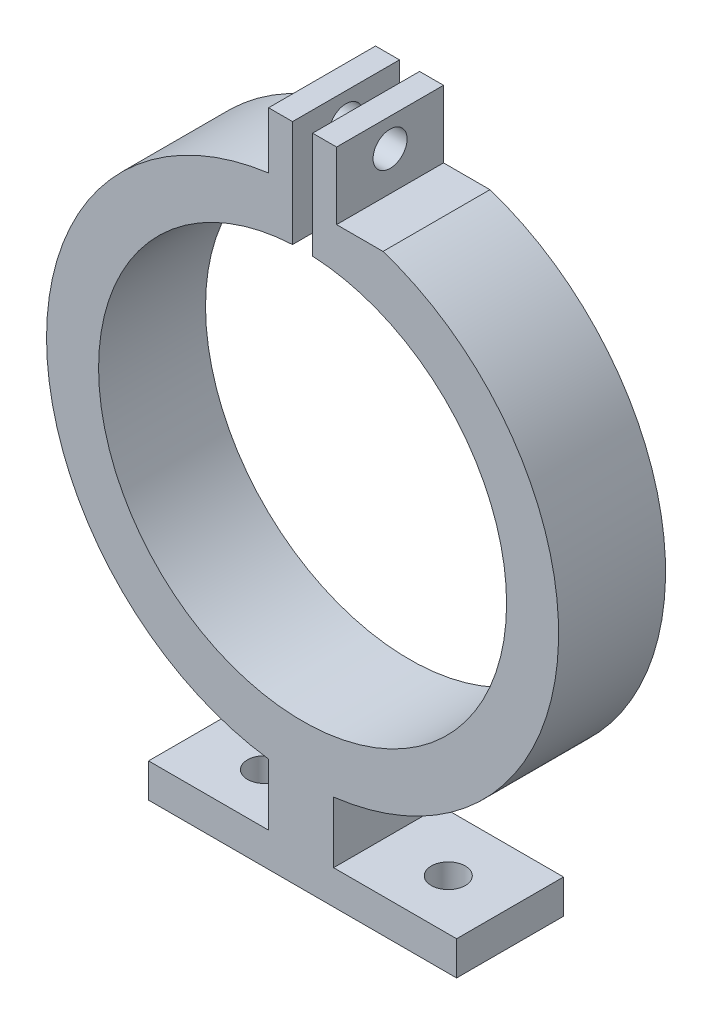
ISO-10303-21;
HEADER;
FILE_DESCRIPTION(('STEP AP214'),'2;1');
FILE_NAME('part.step','',(''),(''),'','','');
FILE_SCHEMA(('AUTOMOTIVE_DESIGN { 1 0 10303 214 1 1 1 1 }'));
ENDSEC;
DATA;
#1=APPLICATION_CONTEXT('core data for automotive mechanical design processes');
#2=APPLICATION_PROTOCOL_DEFINITION('international standard','automotive_design',2000,#1);
#3=PRODUCT_CONTEXT('',#1,'mechanical');
#4=PRODUCT('Part','Part','',(#3));
#5=PRODUCT_RELATED_PRODUCT_CATEGORY('part','',(#4));
#6=PRODUCT_DEFINITION_FORMATION('','',#4);
#7=PRODUCT_DEFINITION_CONTEXT('part definition',#1,'design');
#8=PRODUCT_DEFINITION('design','',#6,#7);
#9=PRODUCT_DEFINITION_SHAPE('','',#8);
#10=(LENGTH_UNIT() NAMED_UNIT(*) SI_UNIT(.MILLI.,.METRE.));
#11=(NAMED_UNIT(*) PLANE_ANGLE_UNIT() SI_UNIT($,.RADIAN.));
#12=(NAMED_UNIT(*) SI_UNIT($,.STERADIAN.) SOLID_ANGLE_UNIT());
#13=UNCERTAINTY_MEASURE_WITH_UNIT(LENGTH_MEASURE(1.E-05),#10,'distance_accuracy_value','');
#14=(GEOMETRIC_REPRESENTATION_CONTEXT(3) GLOBAL_UNCERTAINTY_ASSIGNED_CONTEXT((#13)) GLOBAL_UNIT_ASSIGNED_CONTEXT((#10,
#11,#12)) REPRESENTATION_CONTEXT('',''));
#15=CARTESIAN_POINT('',(0.,0.,0.));
#16=DIRECTION('',(0.,0.,1.));
#17=DIRECTION('',(1.,0.,0.));
#18=AXIS2_PLACEMENT_3D('',#15,#16,#17);
#19=CARTESIAN_POINT('',(0.,0.,10.));
#20=DIRECTION('',(0.,0.,-1.));
#21=DIRECTION('',(-1.,0.,0.));
#22=AXIS2_PLACEMENT_3D('',#19,#20,#21);
#23=CYLINDRICAL_SURFACE('',#22,23.94);
#24=DIRECTION('',(0.,0.,-1.));
#25=VECTOR('',#24,1.);
#26=CARTESIAN_POINT('',(7.52117770646284,22.7278570460967,10.));
#27=LINE('',#26,#25);
#28=CARTESIAN_POINT('',(7.52117770646283,22.7278570460967,10.));
#29=VERTEX_POINT('',#28);
#30=CARTESIAN_POINT('',(7.52117770646283,22.7278570460967,0.));
#31=VERTEX_POINT('',#30);
#32=EDGE_CURVE('E182',#29,#31,#27,.T.);
#33=ORIENTED_EDGE('',*,*,#32,.F.);
#34=CARTESIAN_POINT('',(0.,0.,10.));
#35=DIRECTION('',(0.,0.,1.));
#36=DIRECTION('',(1.,0.,0.));
#37=AXIS2_PLACEMENT_3D('',#34,#35,#36);
#38=CIRCLE('',#37,23.94);
#39=CARTESIAN_POINT('',(2.89957420992693,-23.7637553724391,10.));
#40=VERTEX_POINT('',#39);
#41=EDGE_CURVE('E170',#40,#29,#38,.T.);
#42=ORIENTED_EDGE('',*,*,#41,.F.);
#43=DIRECTION('',(0.,0.,-1.));
#44=VECTOR('',#43,1.);
#45=CARTESIAN_POINT('',(2.89957420992693,-23.7637553724391,10.));
#46=LINE('',#45,#44);
#47=CARTESIAN_POINT('',(2.89957420992693,-23.7637553724391,0.));
#48=VERTEX_POINT('',#47);
#49=EDGE_CURVE('E329',#40,#48,#46,.T.);
#50=ORIENTED_EDGE('',*,*,#49,.T.);
#51=CARTESIAN_POINT('',(0.,0.,0.));
#52=DIRECTION('',(0.,0.,1.));
#53=DIRECTION('',(1.,0.,0.));
#54=AXIS2_PLACEMENT_3D('',#51,#52,#53);
#55=CIRCLE('',#54,23.94);
#56=EDGE_CURVE('E307',#48,#31,#55,.T.);
#57=ORIENTED_EDGE('',*,*,#56,.T.);
#58=EDGE_LOOP('',(#33,#42,#50,#57));
#59=FACE_BOUND('',#58,.T.);
#60=ADVANCED_FACE('F38',(#59),#23,.T.);
#61=CARTESIAN_POINT('',(0.,0.,10.));
#62=DIRECTION('',(0.,0.,-1.));
#63=DIRECTION('',(-1.,0.,0.));
#64=AXIS2_PLACEMENT_3D('',#61,#62,#63);
#65=PLANE('',#64);
#66=DIRECTION('',(-1.,0.,0.));
#67=VECTOR('',#66,1.);
#68=CARTESIAN_POINT('',(32.898,22.7278570460967,10.));
#69=LINE('',#68,#67);
#70=CARTESIAN_POINT('',(3.18,22.7278570460967,10.));
#71=VERTEX_POINT('',#70);
#72=EDGE_CURVE('E174',#29,#71,#69,.T.);
#73=ORIENTED_EDGE('',*,*,#72,.T.);
#74=DIRECTION('',(0.,1.,0.));
#75=VECTOR('',#74,1.);
#76=CARTESIAN_POINT('',(3.18,23.7278570460967,10.));
#77=LINE('',#76,#75);
#78=CARTESIAN_POINT('',(3.18,29.0113324711321,10.));
#79=VERTEX_POINT('',#78);
#80=EDGE_CURVE('E157',#71,#79,#77,.T.);
#81=ORIENTED_EDGE('',*,*,#80,.T.);
#82=DIRECTION('',(-1.,0.,0.));
#83=VECTOR('',#82,1.);
#84=CARTESIAN_POINT('',(-3.18,29.0113324711321,10.));
#85=LINE('',#84,#83);
#86=CARTESIAN_POINT('',(0.938544964266418,29.0113324711321,10.));
#87=VERTEX_POINT('',#86);
#88=EDGE_CURVE('E276',#79,#87,#85,.T.);
#89=ORIENTED_EDGE('',*,*,#88,.T.);
#90=DIRECTION('',(0.,1.,0.));
#91=VECTOR('',#90,1.);
#92=CARTESIAN_POINT('',(0.938544964266418,29.0113324711321,10.));
#93=LINE('',#92,#91);
#94=CARTESIAN_POINT('',(0.938544964266417,19.0518964502238,10.));
#95=VERTEX_POINT('',#94);
#96=EDGE_CURVE('E218',#95,#87,#93,.T.);
#97=ORIENTED_EDGE('',*,*,#96,.F.);
#98=CARTESIAN_POINT('',(0.,0.,10.));
#99=DIRECTION('',(0.,0.,1.));
#100=DIRECTION('',(1.,0.,0.));
#101=AXIS2_PLACEMENT_3D('',#98,#99,#100);
#102=CIRCLE('',#101,19.075);
#103=CARTESIAN_POINT('',(-0.938544964266394,19.0518964502238,10.));
#104=VERTEX_POINT('',#103);
#105=EDGE_CURVE('E230',#104,#95,#102,.T.);
#106=ORIENTED_EDGE('',*,*,#105,.F.);
#107=DIRECTION('',(0.,-1.,0.));
#108=VECTOR('',#107,1.);
#109=CARTESIAN_POINT('',(-0.938544964266418,29.0113324711321,10.));
#110=LINE('',#109,#108);
#111=CARTESIAN_POINT('',(-0.938544964266418,29.0113324711321,10.));
#112=VERTEX_POINT('',#111);
#113=EDGE_CURVE('E61',#112,#104,#110,.T.);
#114=ORIENTED_EDGE('',*,*,#113,.F.);
#115=CARTESIAN_POINT('',(-3.18,29.0113324711321,10.));
#116=VERTEX_POINT('',#115);
#117=EDGE_CURVE('E169',#112,#116,#85,.T.);
#118=ORIENTED_EDGE('',*,*,#117,.T.);
#119=DIRECTION('',(0.,-1.,0.));
#120=VECTOR('',#119,1.);
#121=CARTESIAN_POINT('',(-3.18,23.7278570460967,10.));
#122=LINE('',#121,#120);
#123=CARTESIAN_POINT('',(-3.18,23.7278570460967,10.));
#124=VERTEX_POINT('',#123);
#125=EDGE_CURVE('E279',#116,#124,#122,.T.);
#126=ORIENTED_EDGE('',*,*,#125,.T.);
#127=CARTESIAN_POINT('',(0.,0.,10.));
#128=DIRECTION('',(0.,0.,1.));
#129=DIRECTION('',(-1.,0.,0.));
#130=AXIS2_PLACEMENT_3D('',#127,#128,#129);
#131=CIRCLE('',#130,23.94);
#132=CARTESIAN_POINT('',(-3.18,-23.7278570460967,10.));
#133=VERTEX_POINT('',#132);
#134=EDGE_CURVE('E248',#124,#133,#131,.T.);
#135=ORIENTED_EDGE('',*,*,#134,.T.);
#136=DIRECTION('',(0.,-1.,0.));
#137=VECTOR('',#136,1.);
#138=CARTESIAN_POINT('',(-3.18,-23.7278570460967,10.));
#139=LINE('',#138,#137);
#140=CARTESIAN_POINT('',(-3.18,-29.4861183026498,10.));
#141=VERTEX_POINT('',#140);
#142=EDGE_CURVE('E252',#133,#141,#139,.T.);
#143=ORIENTED_EDGE('',*,*,#142,.T.);
#144=DIRECTION('',(-1.,0.,0.));
#145=VECTOR('',#144,1.);
#146=CARTESIAN_POINT('',(-14.4009100758397,-29.4861183026498,10.));
#147=LINE('',#146,#145);
#148=CARTESIAN_POINT('',(-14.4009100758397,-29.4861183026498,10.));
#149=VERTEX_POINT('',#148);
#150=EDGE_CURVE('E256',#141,#149,#147,.T.);
#151=ORIENTED_EDGE('',*,*,#150,.T.);
#152=DIRECTION('',(0.,-1.,0.));
#153=VECTOR('',#152,1.);
#154=CARTESIAN_POINT('',(-14.4009100758397,-32.6661183026498,10.));
#155=LINE('',#154,#153);
#156=CARTESIAN_POINT('',(-14.4009100758397,-32.6661183026498,10.));
#157=VERTEX_POINT('',#156);
#158=EDGE_CURVE('E259',#149,#157,#155,.T.);
#159=ORIENTED_EDGE('',*,*,#158,.T.);
#160=DIRECTION('',(1.,0.,0.));
#161=VECTOR('',#160,1.);
#162=CARTESIAN_POINT('',(14.4009100758397,-32.6661183026498,10.));
#163=LINE('',#162,#161);
#164=CARTESIAN_POINT('',(14.4009100758397,-32.6661183026498,10.));
#165=VERTEX_POINT('',#164);
#166=EDGE_CURVE('E262',#157,#165,#163,.T.);
#167=ORIENTED_EDGE('',*,*,#166,.T.);
#168=DIRECTION('',(0.,1.,0.));
#169=VECTOR('',#168,1.);
#170=CARTESIAN_POINT('',(14.4009100758397,-32.6661183026498,10.));
#171=LINE('',#170,#169);
#172=CARTESIAN_POINT('',(14.4009100758397,-29.4861183026498,10.));
#173=VERTEX_POINT('',#172);
#174=EDGE_CURVE('E265',#165,#173,#171,.T.);
#175=ORIENTED_EDGE('',*,*,#174,.T.);
#176=DIRECTION('',(-1.,0.,0.));
#177=VECTOR('',#176,1.);
#178=CARTESIAN_POINT('',(14.4009100758397,-29.4861183026498,10.));
#179=LINE('',#178,#177);
#180=CARTESIAN_POINT('',(2.89957420992693,-29.4861183026498,10.));
#181=VERTEX_POINT('',#180);
#182=EDGE_CURVE('E268',#173,#181,#179,.T.);
#183=ORIENTED_EDGE('',*,*,#182,.T.);
#184=DIRECTION('',(0.,1.,0.));
#185=VECTOR('',#184,1.);
#186=CARTESIAN_POINT('',(2.89957420992693,-23.7637553724391,10.));
#187=LINE('',#186,#185);
#188=EDGE_CURVE('E271',#181,#40,#187,.T.);
#189=ORIENTED_EDGE('',*,*,#188,.T.);
#190=ORIENTED_EDGE('',*,*,#41,.T.);
#191=EDGE_LOOP('',(#73,#81,#89,#97,#106,#114,#118,#126,#135,#143,#151,#159,#167,#175,#183,#189,#190));
#192=FACE_BOUND('',#191,.T.);
#193=ADVANCED_FACE('F179',(#192),#65,.F.);
#194=CARTESIAN_POINT('',(0.,0.,0.));
#195=DIRECTION('',(0.,0.,-1.));
#196=DIRECTION('',(-1.,0.,0.));
#197=AXIS2_PLACEMENT_3D('',#194,#195,#196);
#198=PLANE('',#197);
#199=DIRECTION('',(0.,1.,0.));
#200=VECTOR('',#199,1.);
#201=CARTESIAN_POINT('',(3.18,23.7278570460967,0.));
#202=LINE('',#201,#200);
#203=CARTESIAN_POINT('',(3.18,22.7278570460967,0.));
#204=VERTEX_POINT('',#203);
#205=CARTESIAN_POINT('',(3.18,29.0113324711321,0.));
#206=VERTEX_POINT('',#205);
#207=EDGE_CURVE('E53',#204,#206,#202,.T.);
#208=ORIENTED_EDGE('',*,*,#207,.F.);
#209=DIRECTION('',(1.,0.,0.));
#210=VECTOR('',#209,1.);
#211=CARTESIAN_POINT('',(0.,22.7278570460967,0.));
#212=LINE('',#211,#210);
#213=EDGE_CURVE('E11',#204,#31,#212,.T.);
#214=ORIENTED_EDGE('',*,*,#213,.T.);
#215=ORIENTED_EDGE('',*,*,#56,.F.);
#216=DIRECTION('',(0.,1.,0.));
#217=VECTOR('',#216,1.);
#218=CARTESIAN_POINT('',(2.89957420992693,-23.7637553724391,0.));
#219=LINE('',#218,#217);
#220=CARTESIAN_POINT('',(2.89957420992693,-29.4861183026498,0.));
#221=VERTEX_POINT('',#220);
#222=EDGE_CURVE('E304',#221,#48,#219,.T.);
#223=ORIENTED_EDGE('',*,*,#222,.F.);
#224=DIRECTION('',(-1.,0.,0.));
#225=VECTOR('',#224,1.);
#226=CARTESIAN_POINT('',(14.4009100758397,-29.4861183026498,0.));
#227=LINE('',#226,#225);
#228=CARTESIAN_POINT('',(14.4009100758397,-29.4861183026498,0.));
#229=VERTEX_POINT('',#228);
#230=EDGE_CURVE('E301',#229,#221,#227,.T.);
#231=ORIENTED_EDGE('',*,*,#230,.F.);
#232=DIRECTION('',(0.,1.,0.));
#233=VECTOR('',#232,1.);
#234=CARTESIAN_POINT('',(14.4009100758397,-32.6661183026498,0.));
#235=LINE('',#234,#233);
#236=CARTESIAN_POINT('',(14.4009100758397,-32.6661183026498,0.));
#237=VERTEX_POINT('',#236);
#238=EDGE_CURVE('E298',#237,#229,#235,.T.);
#239=ORIENTED_EDGE('',*,*,#238,.F.);
#240=DIRECTION('',(1.,0.,0.));
#241=VECTOR('',#240,1.);
#242=CARTESIAN_POINT('',(14.4009100758397,-32.6661183026498,0.));
#243=LINE('',#242,#241);
#244=CARTESIAN_POINT('',(-14.4009100758397,-32.6661183026498,0.));
#245=VERTEX_POINT('',#244);
#246=EDGE_CURVE('E295',#245,#237,#243,.T.);
#247=ORIENTED_EDGE('',*,*,#246,.F.);
#248=DIRECTION('',(0.,-1.,0.));
#249=VECTOR('',#248,1.);
#250=CARTESIAN_POINT('',(-14.4009100758397,-32.6661183026498,0.));
#251=LINE('',#250,#249);
#252=CARTESIAN_POINT('',(-14.4009100758397,-29.4861183026498,0.));
#253=VERTEX_POINT('',#252);
#254=EDGE_CURVE('E292',#253,#245,#251,.T.);
#255=ORIENTED_EDGE('',*,*,#254,.F.);
#256=DIRECTION('',(-1.,0.,0.));
#257=VECTOR('',#256,1.);
#258=CARTESIAN_POINT('',(-14.4009100758397,-29.4861183026498,0.));
#259=LINE('',#258,#257);
#260=CARTESIAN_POINT('',(-3.18,-29.4861183026498,0.));
#261=VERTEX_POINT('',#260);
#262=EDGE_CURVE('E289',#261,#253,#259,.T.);
#263=ORIENTED_EDGE('',*,*,#262,.F.);
#264=DIRECTION('',(0.,-1.,0.));
#265=VECTOR('',#264,1.);
#266=CARTESIAN_POINT('',(-3.18,-23.7278570460967,0.));
#267=LINE('',#266,#265);
#268=CARTESIAN_POINT('',(-3.18,-23.7278570460967,0.));
#269=VERTEX_POINT('',#268);
#270=EDGE_CURVE('E286',#269,#261,#267,.T.);
#271=ORIENTED_EDGE('',*,*,#270,.F.);
#272=CARTESIAN_POINT('',(0.,0.,0.));
#273=DIRECTION('',(0.,0.,1.));
#274=DIRECTION('',(-1.,0.,0.));
#275=AXIS2_PLACEMENT_3D('',#272,#273,#274);
#276=CIRCLE('',#275,23.94);
#277=CARTESIAN_POINT('',(-3.18,23.7278570460967,0.));
#278=VERTEX_POINT('',#277);
#279=EDGE_CURVE('E244',#278,#269,#276,.T.);
#280=ORIENTED_EDGE('',*,*,#279,.F.);
#281=DIRECTION('',(0.,-1.,0.));
#282=VECTOR('',#281,1.);
#283=CARTESIAN_POINT('',(-3.18,23.7278570460967,0.));
#284=LINE('',#283,#282);
#285=CARTESIAN_POINT('',(-3.18,29.0113324711321,0.));
#286=VERTEX_POINT('',#285);
#287=EDGE_CURVE('E253',#286,#278,#284,.T.);
#288=ORIENTED_EDGE('',*,*,#287,.F.);
#289=DIRECTION('',(-1.,0.,0.));
#290=VECTOR('',#289,1.);
#291=CARTESIAN_POINT('',(-3.18,29.0113324711321,0.));
#292=LINE('',#291,#290);
#293=CARTESIAN_POINT('',(-0.938544964266418,29.0113324711321,0.));
#294=VERTEX_POINT('',#293);
#295=EDGE_CURVE('E313',#294,#286,#292,.T.);
#296=ORIENTED_EDGE('',*,*,#295,.F.);
#297=DIRECTION('',(0.,-1.,0.));
#298=VECTOR('',#297,1.);
#299=CARTESIAN_POINT('',(-0.938544964266418,29.0113324711321,0.));
#300=LINE('',#299,#298);
#301=CARTESIAN_POINT('',(-0.938544964266417,19.0518964502238,0.));
#302=VERTEX_POINT('',#301);
#303=EDGE_CURVE('E213',#294,#302,#300,.T.);
#304=ORIENTED_EDGE('',*,*,#303,.T.);
#305=CARTESIAN_POINT('',(0.,0.,0.));
#306=DIRECTION('',(0.,0.,1.));
#307=DIRECTION('',(1.,0.,0.));
#308=AXIS2_PLACEMENT_3D('',#305,#306,#307);
#309=CIRCLE('',#308,19.075);
#310=CARTESIAN_POINT('',(0.938544964266416,19.0518964502238,0.));
#311=VERTEX_POINT('',#310);
#312=EDGE_CURVE('E240',#302,#311,#309,.T.);
#313=ORIENTED_EDGE('',*,*,#312,.T.);
#314=DIRECTION('',(0.,1.,0.));
#315=VECTOR('',#314,1.);
#316=CARTESIAN_POINT('',(0.938544964266418,29.0113324711321,0.));
#317=LINE('',#316,#315);
#318=CARTESIAN_POINT('',(0.938544964266418,29.0113324711321,0.));
#319=VERTEX_POINT('',#318);
#320=EDGE_CURVE('E217',#311,#319,#317,.T.);
#321=ORIENTED_EDGE('',*,*,#320,.T.);
#322=EDGE_CURVE('E314',#206,#319,#292,.T.);
#323=ORIENTED_EDGE('',*,*,#322,.F.);
#324=EDGE_LOOP('',(#208,#214,#215,#223,#231,#239,#247,#255,#263,#271,#280,#288,#296,#304,#313,
#321,#323));
#325=FACE_BOUND('',#324,.T.);
#326=ADVANCED_FACE('F390',(#325),#198,.T.);
#327=CARTESIAN_POINT('',(-3.18,29.0113324711321,10.));
#328=DIRECTION('',(0.,-1.,0.));
#329=DIRECTION('',(0.,0.,-1.));
#330=AXIS2_PLACEMENT_3D('',#327,#328,#329);
#331=PLANE('',#330);
#332=ORIENTED_EDGE('',*,*,#117,.F.);
#333=DIRECTION('',(0.,0.,1.));
#334=VECTOR('',#333,1.);
#335=CARTESIAN_POINT('',(-0.938544964266418,29.0113324711321,0.));
#336=LINE('',#335,#334);
#337=EDGE_CURVE('E227',#294,#112,#336,.T.);
#338=ORIENTED_EDGE('',*,*,#337,.F.);
#339=ORIENTED_EDGE('',*,*,#295,.T.);
#340=DIRECTION('',(0.,0.,-1.));
#341=VECTOR('',#340,1.);
#342=CARTESIAN_POINT('',(-3.18,29.0113324711321,10.));
#343=LINE('',#342,#341);
#344=EDGE_CURVE('E323',#116,#286,#343,.T.);
#345=ORIENTED_EDGE('',*,*,#344,.F.);
#346=EDGE_LOOP('',(#332,#338,#339,#345));
#347=FACE_BOUND('',#346,.T.);
#348=ADVANCED_FACE('F423',(#347),#331,.F.);
#349=CARTESIAN_POINT('',(0.,0.,10.));
#350=DIRECTION('',(0.,0.,-1.));
#351=DIRECTION('',(-1.,0.,0.));
#352=AXIS2_PLACEMENT_3D('',#349,#350,#351);
#353=CYLINDRICAL_SURFACE('',#352,23.94);
#354=ORIENTED_EDGE('',*,*,#279,.T.);
#355=DIRECTION('',(0.,0.,-1.));
#356=VECTOR('',#355,1.);
#357=CARTESIAN_POINT('',(-3.18,-23.7278570460967,10.));
#358=LINE('',#357,#356);
#359=EDGE_CURVE('E47',#133,#269,#358,.T.);
#360=ORIENTED_EDGE('',*,*,#359,.F.);
#361=ORIENTED_EDGE('',*,*,#134,.F.);
#362=DIRECTION('',(0.,0.,-1.));
#363=VECTOR('',#362,1.);
#364=CARTESIAN_POINT('',(-3.18,23.7278570460967,10.));
#365=LINE('',#364,#363);
#366=EDGE_CURVE('E282',#124,#278,#365,.T.);
#367=ORIENTED_EDGE('',*,*,#366,.T.);
#368=EDGE_LOOP('',(#354,#360,#361,#367));
#369=FACE_BOUND('',#368,.T.);
#370=ADVANCED_FACE('F40',(#369),#353,.T.);
#371=CARTESIAN_POINT('',(-3.18,-23.7278570460967,10.));
#372=DIRECTION('',(1.,0.,0.));
#373=DIRECTION('',(0.,1.,0.));
#374=AXIS2_PLACEMENT_3D('',#371,#372,#373);
#375=PLANE('',#374);
#376=ORIENTED_EDGE('',*,*,#270,.T.);
#377=DIRECTION('',(0.,0.,-1.));
#378=VECTOR('',#377,1.);
#379=CARTESIAN_POINT('',(-3.18,-29.4861183026498,10.));
#380=LINE('',#379,#378);
#381=EDGE_CURVE('E353',#141,#261,#380,.T.);
#382=ORIENTED_EDGE('',*,*,#381,.F.);
#383=ORIENTED_EDGE('',*,*,#142,.F.);
#384=ORIENTED_EDGE('',*,*,#359,.T.);
#385=EDGE_LOOP('',(#376,#382,#383,#384));
#386=FACE_BOUND('',#385,.T.);
#387=ADVANCED_FACE('F416',(#386),#375,.F.);
#388=CARTESIAN_POINT('',(-14.4009100758397,-29.4861183026498,10.));
#389=DIRECTION('',(0.,-1.,0.));
#390=DIRECTION('',(0.,0.,-1.));
#391=AXIS2_PLACEMENT_3D('',#388,#389,#390);
#392=PLANE('',#391);
#393=CARTESIAN_POINT('',(-8.2735005852328,-29.4861183026498,5.28978422119053));
#394=DIRECTION('',(0.,1.,0.));
#395=DIRECTION('',(0.,0.,1.));
#396=AXIS2_PLACEMENT_3D('',#393,#394,#395);
#397=CIRCLE('',#396,1.59);
#398=CARTESIAN_POINT('',(-8.2735005852328,-29.4861183026498,6.87978422119053));
#399=VERTEX_POINT('',#398);
#400=EDGE_CURVE('E185',#399,#399,#397,.T.);
#401=ORIENTED_EDGE('',*,*,#400,.F.);
#402=EDGE_LOOP('',(#401));
#403=FACE_BOUND('',#402,.T.);
#404=ORIENTED_EDGE('',*,*,#262,.T.);
#405=DIRECTION('',(0.,0.,-1.));
#406=VECTOR('',#405,1.);
#407=CARTESIAN_POINT('',(-14.4009100758397,-29.4861183026498,10.));
#408=LINE('',#407,#406);
#409=EDGE_CURVE('E349',#149,#253,#408,.T.);
#410=ORIENTED_EDGE('',*,*,#409,.F.);
#411=ORIENTED_EDGE('',*,*,#150,.F.);
#412=ORIENTED_EDGE('',*,*,#381,.T.);
#413=EDGE_LOOP('',(#404,#410,#411,#412));
#414=FACE_BOUND('',#413,.T.);
#415=ADVANCED_FACE('F413',(#403,#414),#392,.F.);
#416=CARTESIAN_POINT('',(-14.4009100758397,-32.6661183026498,10.));
#417=DIRECTION('',(1.,0.,0.));
#418=DIRECTION('',(0.,0.,-1.));
#419=AXIS2_PLACEMENT_3D('',#416,#417,#418);
#420=PLANE('',#419);
#421=ORIENTED_EDGE('',*,*,#254,.T.);
#422=DIRECTION('',(0.,0.,-1.));
#423=VECTOR('',#422,1.);
#424=CARTESIAN_POINT('',(-14.4009100758397,-32.6661183026498,10.));
#425=LINE('',#424,#423);
#426=EDGE_CURVE('E345',#157,#245,#425,.T.);
#427=ORIENTED_EDGE('',*,*,#426,.F.);
#428=ORIENTED_EDGE('',*,*,#158,.F.);
#429=ORIENTED_EDGE('',*,*,#409,.T.);
#430=EDGE_LOOP('',(#421,#427,#428,#429));
#431=FACE_BOUND('',#430,.T.);
#432=ADVANCED_FACE('F409',(#431),#420,.F.);
#433=CARTESIAN_POINT('',(14.4009100758397,-32.6661183026498,10.));
#434=DIRECTION('',(0.,1.,0.));
#435=DIRECTION('',(0.,0.,1.));
#436=AXIS2_PLACEMENT_3D('',#433,#434,#435);
#437=PLANE('',#436);
#438=CARTESIAN_POINT('',(8.91260895184586,-32.6661183026498,5.28978422119053));
#439=DIRECTION('',(0.,1.,0.));
#440=DIRECTION('',(0.,0.,1.));
#441=AXIS2_PLACEMENT_3D('',#438,#439,#440);
#442=CIRCLE('',#441,1.59);
#443=CARTESIAN_POINT('',(8.91260895184586,-32.6661183026498,6.87978422119053));
#444=VERTEX_POINT('',#443);
#445=EDGE_CURVE('E192',#444,#444,#442,.T.);
#446=ORIENTED_EDGE('',*,*,#445,.T.);
#447=EDGE_LOOP('',(#446));
#448=FACE_BOUND('',#447,.T.);
#449=CARTESIAN_POINT('',(-8.2735005852328,-32.6661183026498,5.28978422119053));
#450=DIRECTION('',(0.,1.,0.));
#451=DIRECTION('',(0.,0.,1.));
#452=AXIS2_PLACEMENT_3D('',#449,#450,#451);
#453=CIRCLE('',#452,1.59);
#454=CARTESIAN_POINT('',(-8.2735005852328,-32.6661183026498,6.87978422119053));
#455=VERTEX_POINT('',#454);
#456=EDGE_CURVE('E199',#455,#455,#453,.T.);
#457=ORIENTED_EDGE('',*,*,#456,.T.);
#458=EDGE_LOOP('',(#457));
#459=FACE_BOUND('',#458,.T.);
#460=ORIENTED_EDGE('',*,*,#246,.T.);
#461=DIRECTION('',(0.,0.,-1.));
#462=VECTOR('',#461,1.);
#463=CARTESIAN_POINT('',(14.4009100758397,-32.6661183026498,10.));
#464=LINE('',#463,#462);
#465=EDGE_CURVE('E341',#165,#237,#464,.T.);
#466=ORIENTED_EDGE('',*,*,#465,.F.);
#467=ORIENTED_EDGE('',*,*,#166,.F.);
#468=ORIENTED_EDGE('',*,*,#426,.T.);
#469=EDGE_LOOP('',(#460,#466,#467,#468));
#470=FACE_BOUND('',#469,.T.);
#471=ADVANCED_FACE('F366',(#448,#459,#470),#437,.F.);
#472=CARTESIAN_POINT('',(14.4009100758397,-32.6661183026498,10.));
#473=DIRECTION('',(-1.,0.,0.));
#474=DIRECTION('',(0.,0.,1.));
#475=AXIS2_PLACEMENT_3D('',#472,#473,#474);
#476=PLANE('',#475);
#477=ORIENTED_EDGE('',*,*,#238,.T.);
#478=DIRECTION('',(0.,0.,-1.));
#479=VECTOR('',#478,1.);
#480=CARTESIAN_POINT('',(14.4009100758397,-29.4861183026498,10.));
#481=LINE('',#480,#479);
#482=EDGE_CURVE('E337',#173,#229,#481,.T.);
#483=ORIENTED_EDGE('',*,*,#482,.F.);
#484=ORIENTED_EDGE('',*,*,#174,.F.);
#485=ORIENTED_EDGE('',*,*,#465,.T.);
#486=EDGE_LOOP('',(#477,#483,#484,#485));
#487=FACE_BOUND('',#486,.T.);
#488=ADVANCED_FACE('F402',(#487),#476,.F.);
#489=CARTESIAN_POINT('',(14.4009100758397,-29.4861183026498,10.));
#490=DIRECTION('',(0.,-1.,0.));
#491=DIRECTION('',(1.,0.,0.));
#492=AXIS2_PLACEMENT_3D('',#489,#490,#491);
#493=PLANE('',#492);
#494=CARTESIAN_POINT('',(8.91260895184586,-29.4861183026498,5.28978422119053));
#495=DIRECTION('',(0.,1.,0.));
#496=DIRECTION('',(0.,0.,1.));
#497=AXIS2_PLACEMENT_3D('',#494,#495,#496);
#498=CIRCLE('',#497,1.59);
#499=CARTESIAN_POINT('',(8.91260895184586,-29.4861183026498,6.87978422119053));
#500=VERTEX_POINT('',#499);
#501=EDGE_CURVE('E188',#500,#500,#498,.T.);
#502=ORIENTED_EDGE('',*,*,#501,.F.);
#503=EDGE_LOOP('',(#502));
#504=FACE_BOUND('',#503,.T.);
#505=ORIENTED_EDGE('',*,*,#230,.T.);
#506=DIRECTION('',(0.,0.,-1.));
#507=VECTOR('',#506,1.);
#508=CARTESIAN_POINT('',(2.89957420992693,-29.4861183026498,10.));
#509=LINE('',#508,#507);
#510=EDGE_CURVE('E333',#181,#221,#509,.T.);
#511=ORIENTED_EDGE('',*,*,#510,.F.);
#512=ORIENTED_EDGE('',*,*,#182,.F.);
#513=ORIENTED_EDGE('',*,*,#482,.T.);
#514=EDGE_LOOP('',(#505,#511,#512,#513));
#515=FACE_BOUND('',#514,.T.);
#516=ADVANCED_FACE('F398',(#504,#515),#493,.F.);
#517=CARTESIAN_POINT('',(2.89957420992693,-23.7637553724391,10.));
#518=DIRECTION('',(-1.,0.,0.));
#519=DIRECTION('',(0.,-1.,0.));
#520=AXIS2_PLACEMENT_3D('',#517,#518,#519);
#521=PLANE('',#520);
#522=ORIENTED_EDGE('',*,*,#222,.T.);
#523=ORIENTED_EDGE('',*,*,#49,.F.);
#524=ORIENTED_EDGE('',*,*,#188,.F.);
#525=ORIENTED_EDGE('',*,*,#510,.T.);
#526=EDGE_LOOP('',(#522,#523,#524,#525));
#527=FACE_BOUND('',#526,.T.);
#528=ADVANCED_FACE('F395',(#527),#521,.F.);
#529=CARTESIAN_POINT('',(3.18,23.7278570460967,10.));
#530=DIRECTION('',(-1.,0.,0.));
#531=DIRECTION('',(0.,0.,1.));
#532=AXIS2_PLACEMENT_3D('',#529,#530,#531);
#533=PLANE('',#532);
#534=CARTESIAN_POINT('',(3.17999999999999,26.3695947586144,5.));
#535=DIRECTION('',(1.,0.,0.));
#536=DIRECTION('',(0.,1.,0.));
#537=AXIS2_PLACEMENT_3D('',#534,#535,#536);
#538=CIRCLE('',#537,1.59);
#539=CARTESIAN_POINT('',(3.17999999999999,27.9595947586144,5.));
#540=VERTEX_POINT('',#539);
#541=EDGE_CURVE('E200',#540,#540,#538,.T.);
#542=ORIENTED_EDGE('',*,*,#541,.F.);
#543=EDGE_LOOP('',(#542));
#544=FACE_BOUND('',#543,.T.);
#545=ORIENTED_EDGE('',*,*,#207,.T.);
#546=DIRECTION('',(0.,0.,-1.));
#547=VECTOR('',#546,1.);
#548=CARTESIAN_POINT('',(3.18,29.0113324711321,10.));
#549=LINE('',#548,#547);
#550=EDGE_CURVE('E163',#79,#206,#549,.T.);
#551=ORIENTED_EDGE('',*,*,#550,.F.);
#552=ORIENTED_EDGE('',*,*,#80,.F.);
#553=DIRECTION('',(0.,0.,-1.));
#554=VECTOR('',#553,1.);
#555=CARTESIAN_POINT('',(3.18,22.7278570460967,10.));
#556=LINE('',#555,#554);
#557=EDGE_CURVE('E160',#71,#204,#556,.T.);
#558=ORIENTED_EDGE('',*,*,#557,.T.);
#559=EDGE_LOOP('',(#545,#551,#552,#558));
#560=FACE_BOUND('',#559,.T.);
#561=ADVANCED_FACE('F159',(#544,#560),#533,.F.);
#562=ORIENTED_EDGE('',*,*,#322,.T.);
#563=DIRECTION('',(0.,0.,1.));
#564=VECTOR('',#563,1.);
#565=CARTESIAN_POINT('',(0.938544964266418,29.0113324711321,0.));
#566=LINE('',#565,#564);
#567=EDGE_CURVE('E231',#319,#87,#566,.T.);
#568=ORIENTED_EDGE('',*,*,#567,.T.);
#569=ORIENTED_EDGE('',*,*,#88,.F.);
#570=ORIENTED_EDGE('',*,*,#550,.T.);
#571=EDGE_LOOP('',(#562,#568,#569,#570));
#572=FACE_BOUND('',#571,.T.);
#573=ADVANCED_FACE('F463',(#572),#331,.F.);
#574=CARTESIAN_POINT('',(-3.18,23.7278570460967,10.));
#575=DIRECTION('',(1.,0.,0.));
#576=DIRECTION('',(0.,0.,-1.));
#577=AXIS2_PLACEMENT_3D('',#574,#575,#576);
#578=PLANE('',#577);
#579=CARTESIAN_POINT('',(-3.18,26.3695947586144,5.));
#580=DIRECTION('',(1.,0.,0.));
#581=DIRECTION('',(0.,0.,-1.));
#582=AXIS2_PLACEMENT_3D('',#579,#580,#581);
#583=CIRCLE('',#582,1.59);
#584=CARTESIAN_POINT('',(-3.18,26.3695947586144,3.41));
#585=VERTEX_POINT('',#584);
#586=EDGE_CURVE('E209',#585,#585,#583,.T.);
#587=ORIENTED_EDGE('',*,*,#586,.T.);
#588=EDGE_LOOP('',(#587));
#589=FACE_BOUND('',#588,.T.);
#590=ORIENTED_EDGE('',*,*,#287,.T.);
#591=ORIENTED_EDGE('',*,*,#366,.F.);
#592=ORIENTED_EDGE('',*,*,#125,.F.);
#593=ORIENTED_EDGE('',*,*,#344,.T.);
#594=EDGE_LOOP('',(#590,#591,#592,#593));
#595=FACE_BOUND('',#594,.T.);
#596=ADVANCED_FACE('F447',(#589,#595),#578,.F.);
#597=CARTESIAN_POINT('',(0.,0.,0.));
#598=DIRECTION('',(0.,0.,1.));
#599=DIRECTION('',(1.,0.,0.));
#600=AXIS2_PLACEMENT_3D('',#597,#598,#599);
#601=CYLINDRICAL_SURFACE('',#600,19.075);
#602=ORIENTED_EDGE('',*,*,#105,.T.);
#603=DIRECTION('',(0.,0.,1.));
#604=VECTOR('',#603,1.);
#605=CARTESIAN_POINT('',(0.938544964266417,19.0518964502238,0.));
#606=LINE('',#605,#604);
#607=EDGE_CURVE('E235',#311,#95,#606,.T.);
#608=ORIENTED_EDGE('',*,*,#607,.F.);
#609=ORIENTED_EDGE('',*,*,#312,.F.);
#610=DIRECTION('',(0.,0.,1.));
#611=VECTOR('',#610,1.);
#612=CARTESIAN_POINT('',(-0.938544964266417,19.0518964502238,0.));
#613=LINE('',#612,#611);
#614=EDGE_CURVE('E222',#302,#104,#613,.T.);
#615=ORIENTED_EDGE('',*,*,#614,.T.);
#616=EDGE_LOOP('',(#602,#608,#609,#615));
#617=FACE_BOUND('',#616,.T.);
#618=ADVANCED_FACE('F458',(#617),#601,.F.);
#619=CARTESIAN_POINT('',(-0.938544964266418,29.0113324711321,0.));
#620=DIRECTION('',(-1.,0.,0.));
#621=DIRECTION('',(0.,-1.,0.));
#622=AXIS2_PLACEMENT_3D('',#619,#620,#621);
#623=PLANE('',#622);
#624=CARTESIAN_POINT('',(-0.938544964266418,26.3695947586144,5.));
#625=DIRECTION('',(-1.,0.,0.));
#626=DIRECTION('',(0.,-1.,0.));
#627=AXIS2_PLACEMENT_3D('',#624,#625,#626);
#628=CIRCLE('',#627,1.59);
#629=CARTESIAN_POINT('',(-0.938544964266418,24.7795947586144,5.));
#630=VERTEX_POINT('',#629);
#631=EDGE_CURVE('E205',#630,#630,#628,.T.);
#632=ORIENTED_EDGE('',*,*,#631,.T.);
#633=EDGE_LOOP('',(#632));
#634=FACE_BOUND('',#633,.T.);
#635=ORIENTED_EDGE('',*,*,#113,.T.);
#636=ORIENTED_EDGE('',*,*,#614,.F.);
#637=ORIENTED_EDGE('',*,*,#303,.F.);
#638=ORIENTED_EDGE('',*,*,#337,.T.);
#639=EDGE_LOOP('',(#635,#636,#637,#638));
#640=FACE_BOUND('',#639,.T.);
#641=ADVANCED_FACE('F460',(#634,#640),#623,.F.);
#642=CARTESIAN_POINT('',(0.938544964266418,29.0113324711321,0.));
#643=DIRECTION('',(1.,0.,0.));
#644=DIRECTION('',(0.,1.,0.));
#645=AXIS2_PLACEMENT_3D('',#642,#643,#644);
#646=PLANE('',#645);
#647=CARTESIAN_POINT('',(0.938544964266418,26.3695947586144,5.));
#648=DIRECTION('',(1.,0.,0.));
#649=DIRECTION('',(0.,1.,0.));
#650=AXIS2_PLACEMENT_3D('',#647,#648,#649);
#651=CIRCLE('',#650,1.59);
#652=CARTESIAN_POINT('',(0.938544964266418,27.9595947586144,5.));
#653=VERTEX_POINT('',#652);
#654=EDGE_CURVE('E204',#653,#653,#651,.T.);
#655=ORIENTED_EDGE('',*,*,#654,.T.);
#656=EDGE_LOOP('',(#655));
#657=FACE_BOUND('',#656,.T.);
#658=ORIENTED_EDGE('',*,*,#96,.T.);
#659=ORIENTED_EDGE('',*,*,#567,.F.);
#660=ORIENTED_EDGE('',*,*,#320,.F.);
#661=ORIENTED_EDGE('',*,*,#607,.T.);
#662=EDGE_LOOP('',(#658,#659,#660,#661));
#663=FACE_BOUND('',#662,.T.);
#664=ADVANCED_FACE('F464',(#657,#663),#646,.F.);
#665=CARTESIAN_POINT('',(-6.82,26.3695947586144,5.));
#666=DIRECTION('',(1.,0.,0.));
#667=DIRECTION('',(0.,1.,0.));
#668=AXIS2_PLACEMENT_3D('',#665,#666,#667);
#669=CYLINDRICAL_SURFACE('',#668,1.59);
#670=ORIENTED_EDGE('',*,*,#541,.T.);
#671=EDGE_LOOP('',(#670));
#672=FACE_BOUND('',#671,.T.);
#673=ORIENTED_EDGE('',*,*,#654,.F.);
#674=EDGE_LOOP('',(#673));
#675=FACE_BOUND('',#674,.T.);
#676=ADVANCED_FACE('F466',(#672,#675),#669,.F.);
#677=ORIENTED_EDGE('',*,*,#631,.F.);
#678=EDGE_LOOP('',(#677));
#679=FACE_BOUND('',#678,.T.);
#680=ORIENTED_EDGE('',*,*,#586,.F.);
#681=EDGE_LOOP('',(#680));
#682=FACE_BOUND('',#681,.T.);
#683=ADVANCED_FACE('F380',(#679,#682),#669,.F.);
#684=CARTESIAN_POINT('',(8.91260895184586,-39.4861183026498,5.28978422119053));
#685=DIRECTION('',(0.,1.,0.));
#686=DIRECTION('',(0.,0.,1.));
#687=AXIS2_PLACEMENT_3D('',#684,#685,#686);
#688=CYLINDRICAL_SURFACE('',#687,1.59);
#689=ORIENTED_EDGE('',*,*,#501,.T.);
#690=EDGE_LOOP('',(#689));
#691=FACE_BOUND('',#690,.T.);
#692=ORIENTED_EDGE('',*,*,#445,.F.);
#693=EDGE_LOOP('',(#692));
#694=FACE_BOUND('',#693,.T.);
#695=ADVANCED_FACE('F371',(#691,#694),#688,.F.);
#696=CARTESIAN_POINT('',(-8.2735005852328,-39.4861183026498,5.28978422119053));
#697=DIRECTION('',(0.,1.,0.));
#698=DIRECTION('',(0.,0.,1.));
#699=AXIS2_PLACEMENT_3D('',#696,#697,#698);
#700=CYLINDRICAL_SURFACE('',#699,1.59);
#701=ORIENTED_EDGE('',*,*,#400,.T.);
#702=EDGE_LOOP('',(#701));
#703=FACE_BOUND('',#702,.T.);
#704=ORIENTED_EDGE('',*,*,#456,.F.);
#705=EDGE_LOOP('',(#704));
#706=FACE_BOUND('',#705,.T.);
#707=ADVANCED_FACE('F369',(#703,#706),#700,.F.);
#708=CARTESIAN_POINT('',(32.898,22.7278570460967,10.));
#709=DIRECTION('',(0.,1.,0.));
#710=DIRECTION('',(0.,0.,1.));
#711=AXIS2_PLACEMENT_3D('',#708,#709,#710);
#712=PLANE('',#711);
#713=ORIENTED_EDGE('',*,*,#32,.T.);
#714=ORIENTED_EDGE('',*,*,#213,.F.);
#715=ORIENTED_EDGE('',*,*,#557,.F.);
#716=ORIENTED_EDGE('',*,*,#72,.F.);
#717=EDGE_LOOP('',(#713,#714,#715,#716));
#718=FACE_BOUND('',#717,.T.);
#719=ADVANCED_FACE('F173',(#718),#712,.T.);
#720=CLOSED_SHELL('',(#60,#193,#326,#348,#370,#387,#415,#432,#471,#488,#516,#528,#561,#573,#596,
#618,#641,#664,#676,#683,#695,#707,#719));
#721=MANIFOLD_SOLID_BREP('B2',#720);
#722=ADVANCED_BREP_SHAPE_REPRESENTATION('',(#18,#721),#14);
#723=SHAPE_DEFINITION_REPRESENTATION(#9,#722);
ENDSEC;
END-ISO-10303-21;
